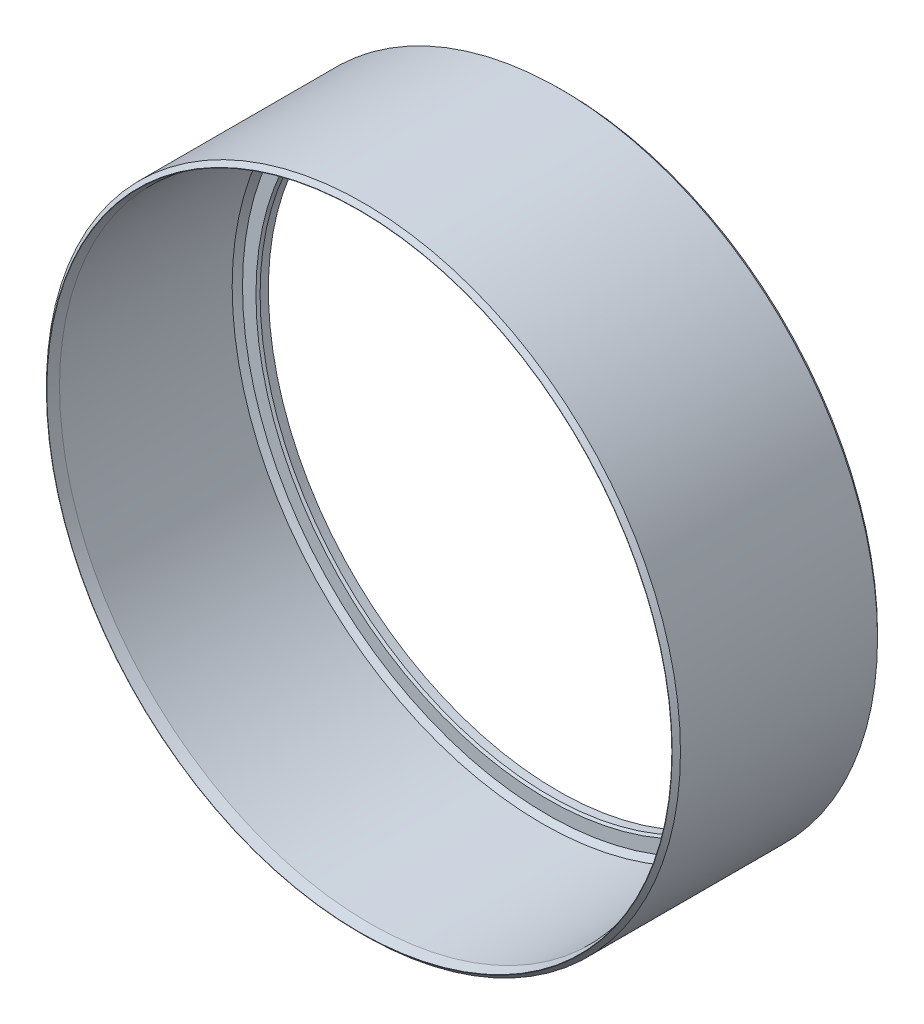
ISO-10303-21;
HEADER;
FILE_DESCRIPTION(('STEP AP214'),'2;1');
FILE_NAME('part.step','',(''),(''),'','','');
FILE_SCHEMA(('AUTOMOTIVE_DESIGN { 1 0 10303 214 1 1 1 1 }'));
ENDSEC;
DATA;
#1=APPLICATION_CONTEXT('core data for automotive mechanical design processes');
#2=APPLICATION_PROTOCOL_DEFINITION('international standard','automotive_design',2000,#1);
#3=PRODUCT_CONTEXT('',#1,'mechanical');
#4=PRODUCT('Part','Part','',(#3));
#5=PRODUCT_RELATED_PRODUCT_CATEGORY('part','',(#4));
#6=PRODUCT_DEFINITION_FORMATION('','',#4);
#7=PRODUCT_DEFINITION_CONTEXT('part definition',#1,'design');
#8=PRODUCT_DEFINITION('design','',#6,#7);
#9=PRODUCT_DEFINITION_SHAPE('','',#8);
#10=(LENGTH_UNIT() NAMED_UNIT(*) SI_UNIT(.MILLI.,.METRE.));
#11=(NAMED_UNIT(*) PLANE_ANGLE_UNIT() SI_UNIT($,.RADIAN.));
#12=(NAMED_UNIT(*) SI_UNIT($,.STERADIAN.) SOLID_ANGLE_UNIT());
#13=UNCERTAINTY_MEASURE_WITH_UNIT(LENGTH_MEASURE(1.E-05),#10,'distance_accuracy_value','');
#14=(GEOMETRIC_REPRESENTATION_CONTEXT(3) GLOBAL_UNCERTAINTY_ASSIGNED_CONTEXT((#13)) GLOBAL_UNIT_ASSIGNED_CONTEXT((#10,
#11,#12)) REPRESENTATION_CONTEXT('',''));
#15=CARTESIAN_POINT('',(0.,0.,0.));
#16=DIRECTION('',(0.,0.,1.));
#17=DIRECTION('',(1.,0.,0.));
#18=AXIS2_PLACEMENT_3D('',#15,#16,#17);
#19=CARTESIAN_POINT('',(0.,-11.75,482.3));
#20=DIRECTION('',(0.,0.,1.));
#21=DIRECTION('',(-1.,0.,0.));
#22=AXIS2_PLACEMENT_3D('',#19,#20,#21);
#23=PLANE('',#22);
#24=CARTESIAN_POINT('',(0.,-11.75,482.3));
#25=DIRECTION('',(0.,0.,-1.));
#26=DIRECTION('',(-1.,0.,0.));
#27=AXIS2_PLACEMENT_3D('',#24,#25,#26);
#28=CIRCLE('',#27,42.3);
#29=CARTESIAN_POINT('',(-42.3,-11.75,482.3));
#30=VERTEX_POINT('',#29);
#31=EDGE_CURVE('E105',#30,#30,#28,.T.);
#32=ORIENTED_EDGE('',*,*,#31,.T.);
#33=EDGE_LOOP('',(#32));
#34=FACE_BOUND('',#33,.T.);
#35=CARTESIAN_POINT('',(0.,-11.75,482.3));
#36=DIRECTION('',(0.,0.,1.));
#37=DIRECTION('',(-1.,0.,0.));
#38=AXIS2_PLACEMENT_3D('',#35,#36,#37);
#39=CIRCLE('',#38,44.25);
#40=CARTESIAN_POINT('',(-44.25,-11.75,482.3));
#41=VERTEX_POINT('',#40);
#42=EDGE_CURVE('E124',#41,#41,#39,.T.);
#43=ORIENTED_EDGE('',*,*,#42,.T.);
#44=EDGE_LOOP('',(#43));
#45=FACE_BOUND('',#44,.T.);
#46=ADVANCED_FACE('F17',(#34,#45),#23,.T.);
#47=CARTESIAN_POINT('',(0.,-11.75,480.8));
#48=DIRECTION('',(0.,0.,1.));
#49=DIRECTION('',(-1.,0.,0.));
#50=AXIS2_PLACEMENT_3D('',#47,#48,#49);
#51=PLANE('',#50);
#52=CARTESIAN_POINT('',(0.,-11.75,480.8));
#53=DIRECTION('',(0.,0.,1.));
#54=DIRECTION('',(-1.,0.,0.));
#55=AXIS2_PLACEMENT_3D('',#52,#53,#54);
#56=CIRCLE('',#55,42.);
#57=CARTESIAN_POINT('',(42.,-11.75,480.8));
#58=VERTEX_POINT('',#57);
#59=EDGE_CURVE('E201',#58,#58,#56,.T.);
#60=ORIENTED_EDGE('',*,*,#59,.T.);
#61=EDGE_LOOP('',(#60));
#62=FACE_BOUND('',#61,.T.);
#63=CARTESIAN_POINT('',(0.,-11.75,480.8));
#64=DIRECTION('',(0.,0.,1.));
#65=DIRECTION('',(-1.,0.,0.));
#66=AXIS2_PLACEMENT_3D('',#63,#64,#65);
#67=CIRCLE('',#66,44.3);
#68=CARTESIAN_POINT('',(-44.3,-11.75,480.8));
#69=VERTEX_POINT('',#68);
#70=EDGE_CURVE('E77',#69,#69,#67,.T.);
#71=ORIENTED_EDGE('',*,*,#70,.F.);
#72=EDGE_LOOP('',(#71));
#73=FACE_BOUND('',#72,.T.);
#74=ADVANCED_FACE('F168',(#62,#73),#51,.F.);
#75=CARTESIAN_POINT('',(0.,-11.75,479.8));
#76=DIRECTION('',(0.,0.,1.));
#77=DIRECTION('',(-1.,0.,0.));
#78=AXIS2_PLACEMENT_3D('',#75,#76,#77);
#79=PLANE('',#78);
#80=CARTESIAN_POINT('',(0.,-11.75,479.8));
#81=DIRECTION('',(0.,0.,1.));
#82=DIRECTION('',(-1.,0.,0.));
#83=AXIS2_PLACEMENT_3D('',#80,#81,#82);
#84=CIRCLE('',#83,44.55);
#85=CARTESIAN_POINT('',(44.55,-11.75,479.8));
#86=VERTEX_POINT('',#85);
#87=EDGE_CURVE('E21',#86,#86,#84,.T.);
#88=ORIENTED_EDGE('',*,*,#87,.T.);
#89=EDGE_LOOP('',(#88));
#90=FACE_BOUND('',#89,.T.);
#91=CARTESIAN_POINT('',(0.,-11.75,479.8));
#92=DIRECTION('',(0.,0.,-1.));
#93=DIRECTION('',(-1.,0.,0.));
#94=AXIS2_PLACEMENT_3D('',#91,#92,#93);
#95=CIRCLE('',#94,45.4);
#96=CARTESIAN_POINT('',(-45.4,-11.75,479.8));
#97=VERTEX_POINT('',#96);
#98=EDGE_CURVE('E67',#97,#97,#95,.T.);
#99=ORIENTED_EDGE('',*,*,#98,.T.);
#100=EDGE_LOOP('',(#99));
#101=FACE_BOUND('',#100,.T.);
#102=ADVANCED_FACE('F172',(#90,#101),#79,.F.);
#103=CARTESIAN_POINT('',(0.,-11.75,509.6));
#104=DIRECTION('',(0.,0.,1.));
#105=DIRECTION('',(-1.,0.,0.));
#106=AXIS2_PLACEMENT_3D('',#103,#104,#105);
#107=PLANE('',#106);
#108=CARTESIAN_POINT('',(0.,-11.75,509.6));
#109=DIRECTION('',(0.,0.,-1.));
#110=DIRECTION('',(1.,0.,0.));
#111=AXIS2_PLACEMENT_3D('',#108,#109,#110);
#112=CIRCLE('',#111,45.35);
#113=CARTESIAN_POINT('',(-45.35,-11.75,509.6));
#114=VERTEX_POINT('',#113);
#115=EDGE_CURVE('E121',#114,#114,#112,.T.);
#116=ORIENTED_EDGE('',*,*,#115,.T.);
#117=EDGE_LOOP('',(#116));
#118=FACE_BOUND('',#117,.T.);
#119=CARTESIAN_POINT('',(0.,-11.75,509.6));
#120=DIRECTION('',(0.,0.,1.));
#121=DIRECTION('',(-1.,0.,0.));
#122=AXIS2_PLACEMENT_3D('',#119,#120,#121);
#123=CIRCLE('',#122,45.4);
#124=CARTESIAN_POINT('',(45.4,-11.75,509.6));
#125=VERTEX_POINT('',#124);
#126=EDGE_CURVE('E28',#125,#125,#123,.T.);
#127=ORIENTED_EDGE('',*,*,#126,.T.);
#128=EDGE_LOOP('',(#127));
#129=FACE_BOUND('',#128,.T.);
#130=ADVANCED_FACE('F147',(#118,#129),#107,.T.);
#131=CARTESIAN_POINT('',(0.,-11.75,509.6));
#132=DIRECTION('',(0.,0.,-1.));
#133=DIRECTION('',(1.,0.,0.));
#134=AXIS2_PLACEMENT_3D('',#131,#132,#133);
#135=CYLINDRICAL_SURFACE('',#134,45.);
#136=CARTESIAN_POINT('',(0.,-11.75,483.05));
#137=DIRECTION('',(0.,0.,-1.));
#138=DIRECTION('',(-1.,0.,0.));
#139=AXIS2_PLACEMENT_3D('',#136,#137,#138);
#140=CIRCLE('',#139,45.);
#141=CARTESIAN_POINT('',(-45.,-11.75,483.05));
#142=VERTEX_POINT('',#141);
#143=EDGE_CURVE('E118',#142,#142,#140,.T.);
#144=ORIENTED_EDGE('',*,*,#143,.T.);
#145=EDGE_LOOP('',(#144));
#146=FACE_BOUND('',#145,.T.);
#147=CARTESIAN_POINT('',(0.,-11.75,508.1));
#148=DIRECTION('',(0.,0.,-1.));
#149=DIRECTION('',(1.,0.,0.));
#150=AXIS2_PLACEMENT_3D('',#147,#148,#149);
#151=CIRCLE('',#150,45.);
#152=CARTESIAN_POINT('',(45.,-11.75,508.1));
#153=VERTEX_POINT('',#152);
#154=EDGE_CURVE('E137',#153,#153,#151,.T.);
#155=ORIENTED_EDGE('',*,*,#154,.F.);
#156=EDGE_LOOP('',(#155));
#157=FACE_BOUND('',#156,.T.);
#158=ADVANCED_FACE('F163',(#146,#157),#135,.F.);
#159=CARTESIAN_POINT('',(0.,-11.75,509.6));
#160=DIRECTION('',(0.,0.,-1.));
#161=DIRECTION('',(1.,0.,0.));
#162=AXIS2_PLACEMENT_3D('',#159,#160,#161);
#163=CYLINDRICAL_SURFACE('',#162,46.);
#164=CARTESIAN_POINT('',(0.,-11.75,480.4));
#165=DIRECTION('',(0.,0.,1.));
#166=DIRECTION('',(-1.,0.,0.));
#167=AXIS2_PLACEMENT_3D('',#164,#165,#166);
#168=CIRCLE('',#167,46.);
#169=CARTESIAN_POINT('',(-46.,-11.75,480.4));
#170=VERTEX_POINT('',#169);
#171=EDGE_CURVE('E59',#170,#170,#168,.T.);
#172=ORIENTED_EDGE('',*,*,#171,.T.);
#173=EDGE_LOOP('',(#172));
#174=FACE_BOUND('',#173,.T.);
#175=CARTESIAN_POINT('',(0.,-11.75,509.));
#176=DIRECTION('',(0.,0.,-1.));
#177=DIRECTION('',(-1.,0.,0.));
#178=AXIS2_PLACEMENT_3D('',#175,#176,#177);
#179=CIRCLE('',#178,46.);
#180=CARTESIAN_POINT('',(46.,-11.75,509.));
#181=VERTEX_POINT('',#180);
#182=EDGE_CURVE('E11',#181,#181,#179,.T.);
#183=ORIENTED_EDGE('',*,*,#182,.T.);
#184=EDGE_LOOP('',(#183));
#185=FACE_BOUND('',#184,.T.);
#186=ADVANCED_FACE('F152',(#174,#185),#163,.T.);
#187=CARTESIAN_POINT('',(0.,-11.75,509.6));
#188=DIRECTION('',(0.,0.,-1.));
#189=DIRECTION('',(1.,0.,0.));
#190=AXIS2_PLACEMENT_3D('',#187,#188,#189);
#191=CONICAL_SURFACE('',#190,45.4,0.785398163397454);
#192=ORIENTED_EDGE('',*,*,#182,.F.);
#193=EDGE_LOOP('',(#192));
#194=FACE_BOUND('',#193,.T.);
#195=ORIENTED_EDGE('',*,*,#126,.F.);
#196=EDGE_LOOP('',(#195));
#197=FACE_BOUND('',#196,.T.);
#198=ADVANCED_FACE('F149',(#194,#197),#191,.T.);
#199=CARTESIAN_POINT('',(0.,-11.75,480.4));
#200=DIRECTION('',(0.,0.,1.));
#201=DIRECTION('',(-1.,0.,0.));
#202=AXIS2_PLACEMENT_3D('',#199,#200,#201);
#203=CONICAL_SURFACE('',#202,46.,0.78539816339746);
#204=ORIENTED_EDGE('',*,*,#171,.F.);
#205=EDGE_LOOP('',(#204));
#206=FACE_BOUND('',#205,.T.);
#207=ORIENTED_EDGE('',*,*,#98,.F.);
#208=EDGE_LOOP('',(#207));
#209=FACE_BOUND('',#208,.T.);
#210=ADVANCED_FACE('F151',(#206,#209),#203,.T.);
#211=CARTESIAN_POINT('',(0.,-11.75,480.8));
#212=DIRECTION('',(0.,0.,-1.));
#213=DIRECTION('',(1.,0.,0.));
#214=AXIS2_PLACEMENT_3D('',#211,#212,#213);
#215=CYLINDRICAL_SURFACE('',#214,44.3);
#216=CARTESIAN_POINT('',(0.,-11.75,480.05));
#217=DIRECTION('',(0.,0.,-1.));
#218=DIRECTION('',(-1.,0.,0.));
#219=AXIS2_PLACEMENT_3D('',#216,#217,#218);
#220=CIRCLE('',#219,44.3);
#221=CARTESIAN_POINT('',(44.3,-11.75,480.05));
#222=VERTEX_POINT('',#221);
#223=EDGE_CURVE('E109',#222,#222,#220,.T.);
#224=ORIENTED_EDGE('',*,*,#223,.T.);
#225=EDGE_LOOP('',(#224));
#226=FACE_BOUND('',#225,.T.);
#227=ORIENTED_EDGE('',*,*,#70,.T.);
#228=EDGE_LOOP('',(#227));
#229=FACE_BOUND('',#228,.T.);
#230=ADVANCED_FACE('F160',(#226,#229),#215,.F.);
#231=CARTESIAN_POINT('',(0.,-11.75,482.3));
#232=DIRECTION('',(0.,0.,-1.));
#233=DIRECTION('',(1.,0.,0.));
#234=AXIS2_PLACEMENT_3D('',#231,#232,#233);
#235=CYLINDRICAL_SURFACE('',#234,42.);
#236=ORIENTED_EDGE('',*,*,#59,.F.);
#237=EDGE_LOOP('',(#236));
#238=FACE_BOUND('',#237,.T.);
#239=CARTESIAN_POINT('',(0.,-11.75,482.));
#240=DIRECTION('',(0.,0.,1.));
#241=DIRECTION('',(-1.,0.,0.));
#242=AXIS2_PLACEMENT_3D('',#239,#240,#241);
#243=CIRCLE('',#242,42.);
#244=CARTESIAN_POINT('',(-42.,-11.75,482.));
#245=VERTEX_POINT('',#244);
#246=EDGE_CURVE('E110',#245,#245,#243,.T.);
#247=ORIENTED_EDGE('',*,*,#246,.T.);
#248=EDGE_LOOP('',(#247));
#249=FACE_BOUND('',#248,.T.);
#250=ADVANCED_FACE('F19',(#238,#249),#235,.F.);
#251=CARTESIAN_POINT('',(0.,-11.75,479.8));
#252=DIRECTION('',(0.,0.,-1.));
#253=DIRECTION('',(1.,0.,0.));
#254=AXIS2_PLACEMENT_3D('',#251,#252,#253);
#255=CONICAL_SURFACE('',#254,44.55,0.785398163397435);
#256=ORIENTED_EDGE('',*,*,#87,.F.);
#257=EDGE_LOOP('',(#256));
#258=FACE_BOUND('',#257,.T.);
#259=ORIENTED_EDGE('',*,*,#223,.F.);
#260=EDGE_LOOP('',(#259));
#261=FACE_BOUND('',#260,.T.);
#262=ADVANCED_FACE('F214',(#258,#261),#255,.F.);
#263=CARTESIAN_POINT('',(0.,-11.75,482.));
#264=DIRECTION('',(0.,0.,1.));
#265=DIRECTION('',(-1.,0.,0.));
#266=AXIS2_PLACEMENT_3D('',#263,#264,#265);
#267=CONICAL_SURFACE('',#266,42.,0.785398163397472);
#268=ORIENTED_EDGE('',*,*,#31,.F.);
#269=EDGE_LOOP('',(#268));
#270=FACE_BOUND('',#269,.T.);
#271=ORIENTED_EDGE('',*,*,#246,.F.);
#272=EDGE_LOOP('',(#271));
#273=FACE_BOUND('',#272,.T.);
#274=ADVANCED_FACE('F182',(#270,#273),#267,.F.);
#275=CARTESIAN_POINT('',(0.,-11.75,482.3));
#276=DIRECTION('',(0.,0.,1.));
#277=DIRECTION('',(-1.,0.,0.));
#278=AXIS2_PLACEMENT_3D('',#275,#276,#277);
#279=CONICAL_SURFACE('',#278,44.25,0.785398163397448);
#280=ORIENTED_EDGE('',*,*,#143,.F.);
#281=EDGE_LOOP('',(#280));
#282=FACE_BOUND('',#281,.T.);
#283=ORIENTED_EDGE('',*,*,#42,.F.);
#284=EDGE_LOOP('',(#283));
#285=FACE_BOUND('',#284,.T.);
#286=ADVANCED_FACE('F179',(#282,#285),#279,.F.);
#287=CARTESIAN_POINT('',(0.,-11.75,509.6));
#288=DIRECTION('',(0.,0.,1.));
#289=DIRECTION('',(-1.,0.,0.));
#290=AXIS2_PLACEMENT_3D('',#287,#288,#289);
#291=CONICAL_SURFACE('',#290,45.35,0.229231933276997);
#292=ORIENTED_EDGE('',*,*,#115,.F.);
#293=EDGE_LOOP('',(#292));
#294=FACE_BOUND('',#293,.T.);
#295=ORIENTED_EDGE('',*,*,#154,.T.);
#296=EDGE_LOOP('',(#295));
#297=FACE_BOUND('',#296,.T.);
#298=ADVANCED_FACE('F181',(#294,#297),#291,.F.);
#299=CLOSED_SHELL('',(#46,#74,#102,#130,#158,#186,#198,#210,#230,#250,#262,#274,#286,#298));
#300=MANIFOLD_SOLID_BREP('B1',#299);
#301=ADVANCED_BREP_SHAPE_REPRESENTATION('',(#18,#300),#14);
#302=SHAPE_DEFINITION_REPRESENTATION(#9,#301);
ENDSEC;
END-ISO-10303-21;
